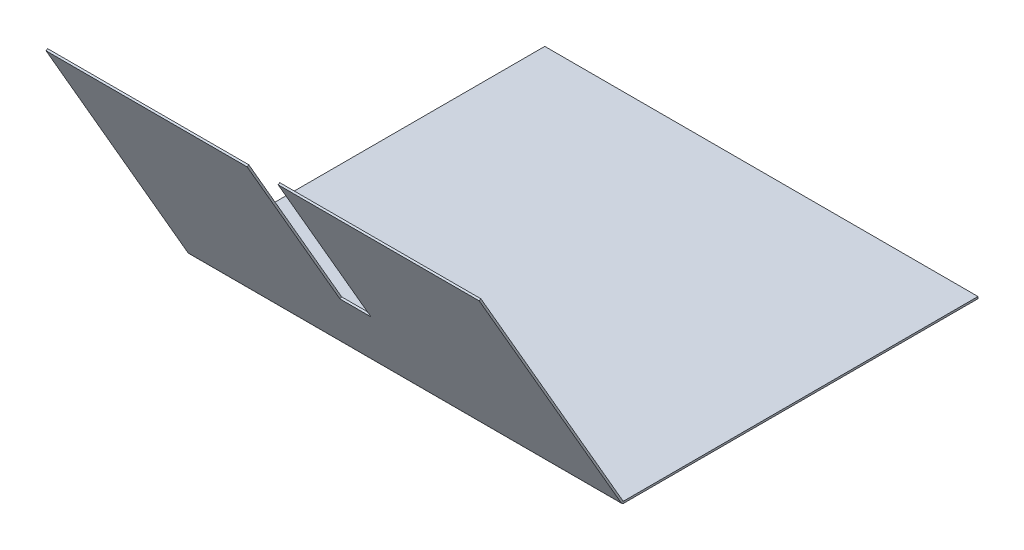
ISO-10303-21;
HEADER;
FILE_DESCRIPTION(('STEP AP214'),'2;1');
FILE_NAME('part.step','',(''),(''),'','','');
FILE_SCHEMA(('AUTOMOTIVE_DESIGN { 1 0 10303 214 1 1 1 1 }'));
ENDSEC;
DATA;
#1=APPLICATION_CONTEXT('core data for automotive mechanical design processes');
#2=APPLICATION_PROTOCOL_DEFINITION('international standard','automotive_design',2000,#1);
#3=PRODUCT_CONTEXT('',#1,'mechanical');
#4=PRODUCT('Part','Part','',(#3));
#5=PRODUCT_RELATED_PRODUCT_CATEGORY('part','',(#4));
#6=PRODUCT_DEFINITION_FORMATION('','',#4);
#7=PRODUCT_DEFINITION_CONTEXT('part definition',#1,'design');
#8=PRODUCT_DEFINITION('design','',#6,#7);
#9=PRODUCT_DEFINITION_SHAPE('','',#8);
#10=(LENGTH_UNIT() NAMED_UNIT(*) SI_UNIT(.MILLI.,.METRE.));
#11=(NAMED_UNIT(*) PLANE_ANGLE_UNIT() SI_UNIT($,.RADIAN.));
#12=(NAMED_UNIT(*) SI_UNIT($,.STERADIAN.) SOLID_ANGLE_UNIT());
#13=UNCERTAINTY_MEASURE_WITH_UNIT(LENGTH_MEASURE(1.E-05),#10,'distance_accuracy_value','');
#14=(GEOMETRIC_REPRESENTATION_CONTEXT(3) GLOBAL_UNCERTAINTY_ASSIGNED_CONTEXT((#13)) GLOBAL_UNIT_ASSIGNED_CONTEXT((#10,
#11,#12)) REPRESENTATION_CONTEXT('',''));
#15=CARTESIAN_POINT('',(0.,0.,0.));
#16=DIRECTION('',(0.,0.,1.));
#17=DIRECTION('',(1.,0.,0.));
#18=AXIS2_PLACEMENT_3D('',#15,#16,#17);
#19=CARTESIAN_POINT('',(-355.6,203.2,409.417574699331));
#20=DIRECTION('',(0.,-0.866025403784453,-0.499999999999976));
#21=DIRECTION('',(0.,0.499999999999976,-0.866025403784453));
#22=AXIS2_PLACEMENT_3D('',#19,#20,#21);
#23=PLANE('',#22);
#24=DIRECTION('',(1.,0.,0.));
#25=VECTOR('',#24,1.);
#26=CARTESIAN_POINT('',(-355.6,203.2,409.417574699331));
#27=LINE('',#26,#25);
#28=CARTESIAN_POINT('',(-355.6,203.2,409.417574699331));
#29=VERTEX_POINT('',#28);
#30=CARTESIAN_POINT('',(-190.5,203.2,409.417574699331));
#31=VERTEX_POINT('',#30);
#32=EDGE_CURVE('E186',#29,#31,#27,.T.);
#33=ORIENTED_EDGE('',*,*,#32,.T.);
#34=DIRECTION('',(0.,0.499999999999976,-0.866025403784453));
#35=VECTOR('',#34,1.);
#36=CARTESIAN_POINT('',(-190.5,203.2,409.417574699331));
#37=LINE('',#36,#35);
#38=CARTESIAN_POINT('',(-190.5,203.99375,408.042759370823));
#39=VERTEX_POINT('',#38);
#40=EDGE_CURVE('E11',#31,#39,#37,.T.);
#41=ORIENTED_EDGE('',*,*,#40,.T.);
#42=DIRECTION('',(1.,0.,0.));
#43=VECTOR('',#42,1.);
#44=CARTESIAN_POINT('',(-355.6,203.99375,408.042759370823));
#45=LINE('',#44,#43);
#46=CARTESIAN_POINT('',(-355.6,203.99375,408.042759370823));
#47=VERTEX_POINT('',#46);
#48=EDGE_CURVE('E190',#47,#39,#45,.T.);
#49=ORIENTED_EDGE('',*,*,#48,.F.);
#50=DIRECTION('',(0.,0.499999999999976,-0.866025403784453));
#51=VECTOR('',#50,1.);
#52=CARTESIAN_POINT('',(-355.6,203.2,409.417574699331));
#53=LINE('',#52,#51);
#54=EDGE_CURVE('E104',#29,#47,#53,.T.);
#55=ORIENTED_EDGE('',*,*,#54,.F.);
#56=EDGE_LOOP('',(#33,#41,#49,#55));
#57=FACE_BOUND('',#56,.T.);
#58=ADVANCED_FACE('F37',(#57),#23,.F.);
#59=CARTESIAN_POINT('',(-355.6,0.,290.758180239376));
#60=DIRECTION('',(-1.,0.,0.));
#61=DIRECTION('',(0.,0.,1.));
#62=AXIS2_PLACEMENT_3D('',#59,#60,#61);
#63=PLANE('',#62);
#64=DIRECTION('',(0.,1.,0.));
#65=VECTOR('',#64,1.);
#66=CARTESIAN_POINT('',(-355.6,0.,290.758180239376));
#67=LINE('',#66,#65);
#68=CARTESIAN_POINT('',(-355.6,0.,290.758180239376));
#69=VERTEX_POINT('',#68);
#70=CARTESIAN_POINT('',(-355.6,1.58749999999996,290.758180239376));
#71=VERTEX_POINT('',#70);
#72=EDGE_CURVE('E144',#69,#71,#67,.T.);
#73=ORIENTED_EDGE('',*,*,#72,.F.);
#74=CARTESIAN_POINT('',(-355.6,2.32409999999996,290.758180239376));
#75=DIRECTION('',(1.,0.,0.));
#76=DIRECTION('',(0.,0.,-1.));
#77=AXIS2_PLACEMENT_3D('',#74,#75,#76);
#78=CIRCLE('',#77,2.3241);
#79=CARTESIAN_POINT('',(-355.6,1.16204999999998,292.770909880312));
#80=VERTEX_POINT('',#79);
#81=EDGE_CURVE('E223',#69,#80,#78,.F.);
#82=ORIENTED_EDGE('',*,*,#81,.T.);
#83=DIRECTION('',(0.,-0.499999999999998,0.86602540378444));
#84=VECTOR('',#83,1.);
#85=CARTESIAN_POINT('',(-355.6,1.95579999999998,291.396094551804));
#86=LINE('',#85,#84);
#87=CARTESIAN_POINT('',(-355.6,1.95579999999998,291.396094551804));
#88=VERTEX_POINT('',#87);
#89=EDGE_CURVE('E61',#88,#80,#86,.T.);
#90=ORIENTED_EDGE('',*,*,#89,.F.);
#91=CARTESIAN_POINT('',(-355.6,2.32409999999996,290.758180239376));
#92=DIRECTION('',(1.,0.,0.));
#93=DIRECTION('',(0.,0.,-1.));
#94=AXIS2_PLACEMENT_3D('',#91,#92,#93);
#95=CIRCLE('',#94,0.7366);
#96=EDGE_CURVE('E146',#71,#88,#95,.F.);
#97=ORIENTED_EDGE('',*,*,#96,.F.);
#98=EDGE_LOOP('',(#73,#82,#90,#97));
#99=FACE_BOUND('',#98,.T.);
#100=ADVANCED_FACE('F39',(#99),#63,.T.);
#101=CARTESIAN_POINT('',(-355.6,1.95579999999998,291.396094551804));
#102=DIRECTION('',(-1.,0.,0.));
#103=DIRECTION('',(0.,0.,1.));
#104=AXIS2_PLACEMENT_3D('',#101,#102,#103);
#105=PLANE('',#104);
#106=DIRECTION('',(0.,0.,1.));
#107=VECTOR('',#106,1.);
#108=CARTESIAN_POINT('',(-355.6,0.,0.));
#109=LINE('',#108,#107);
#110=CARTESIAN_POINT('',(-355.6,0.,0.));
#111=VERTEX_POINT('',#110);
#112=EDGE_CURVE('E141',#111,#69,#109,.T.);
#113=ORIENTED_EDGE('',*,*,#112,.T.);
#114=ORIENTED_EDGE('',*,*,#72,.T.);
#115=DIRECTION('',(0.,0.,1.));
#116=VECTOR('',#115,1.);
#117=CARTESIAN_POINT('',(-355.6,1.5875,0.));
#118=LINE('',#117,#116);
#119=CARTESIAN_POINT('',(-355.6,1.5875,0.));
#120=VERTEX_POINT('',#119);
#121=EDGE_CURVE('E126',#120,#71,#118,.T.);
#122=ORIENTED_EDGE('',*,*,#121,.F.);
#123=DIRECTION('',(0.,-1.,0.));
#124=VECTOR('',#123,1.);
#125=CARTESIAN_POINT('',(-355.6,1.5875,0.));
#126=LINE('',#125,#124);
#127=EDGE_CURVE('E135',#120,#111,#126,.T.);
#128=ORIENTED_EDGE('',*,*,#127,.T.);
#129=EDGE_LOOP('',(#113,#114,#122,#128));
#130=FACE_BOUND('',#129,.T.);
#131=ADVANCED_FACE('F143',(#130),#105,.T.);
#132=CARTESIAN_POINT('',(0.,1.16204999999998,292.770909880312));
#133=DIRECTION('',(1.,0.,0.));
#134=DIRECTION('',(0.,0.,-1.));
#135=AXIS2_PLACEMENT_3D('',#132,#133,#134);
#136=PLANE('',#135);
#137=DIRECTION('',(0.,0.499999999999998,-0.86602540378444));
#138=VECTOR('',#137,1.);
#139=CARTESIAN_POINT('',(0.,1.16204999999998,292.770909880312));
#140=LINE('',#139,#138);
#141=CARTESIAN_POINT('',(0.,1.16204999999998,292.770909880312));
#142=VERTEX_POINT('',#141);
#143=CARTESIAN_POINT('',(0.,1.95579999999998,291.396094551804));
#144=VERTEX_POINT('',#143);
#145=EDGE_CURVE('E95',#142,#144,#140,.T.);
#146=ORIENTED_EDGE('',*,*,#145,.F.);
#147=CARTESIAN_POINT('',(0.,2.32409999999996,290.758180239376));
#148=DIRECTION('',(1.,0.,0.));
#149=DIRECTION('',(0.,0.,-1.));
#150=AXIS2_PLACEMENT_3D('',#147,#148,#149);
#151=CIRCLE('',#150,2.3241);
#152=CARTESIAN_POINT('',(0.,0.,290.758180239376));
#153=VERTEX_POINT('',#152);
#154=EDGE_CURVE('E162',#153,#142,#151,.F.);
#155=ORIENTED_EDGE('',*,*,#154,.F.);
#156=DIRECTION('',(0.,-1.,0.));
#157=VECTOR('',#156,1.);
#158=CARTESIAN_POINT('',(0.,1.58749999999996,290.758180239376));
#159=LINE('',#158,#157);
#160=CARTESIAN_POINT('',(0.,1.58749999999996,290.758180239376));
#161=VERTEX_POINT('',#160);
#162=EDGE_CURVE('E177',#161,#153,#159,.T.);
#163=ORIENTED_EDGE('',*,*,#162,.F.);
#164=CARTESIAN_POINT('',(0.,2.32409999999996,290.758180239376));
#165=DIRECTION('',(1.,0.,0.));
#166=DIRECTION('',(0.,0.,-1.));
#167=AXIS2_PLACEMENT_3D('',#164,#165,#166);
#168=CIRCLE('',#167,0.7366);
#169=EDGE_CURVE('E171',#161,#144,#168,.F.);
#170=ORIENTED_EDGE('',*,*,#169,.T.);
#171=EDGE_LOOP('',(#146,#155,#163,#170));
#172=FACE_BOUND('',#171,.T.);
#173=ADVANCED_FACE('F218',(#172),#136,.T.);
#174=CARTESIAN_POINT('',(0.,1.58749999999996,290.758180239376));
#175=DIRECTION('',(1.,0.,0.));
#176=DIRECTION('',(0.,0.,-1.));
#177=AXIS2_PLACEMENT_3D('',#174,#175,#176);
#178=PLANE('',#177);
#179=DIRECTION('',(0.,0.86602540378444,0.499999999999998));
#180=VECTOR('',#179,1.);
#181=CARTESIAN_POINT('',(0.,0.,292.1));
#182=LINE('',#181,#180);
#183=CARTESIAN_POINT('',(0.,203.2,409.417574699331));
#184=VERTEX_POINT('',#183);
#185=EDGE_CURVE('E159',#142,#184,#182,.T.);
#186=ORIENTED_EDGE('',*,*,#185,.F.);
#187=ORIENTED_EDGE('',*,*,#145,.T.);
#188=DIRECTION('',(0.,0.86602540378444,0.499999999999998));
#189=VECTOR('',#188,1.);
#190=CARTESIAN_POINT('',(0.,0.793749999999961,290.725184671492));
#191=LINE('',#190,#189);
#192=CARTESIAN_POINT('',(0.,203.99375,408.042759370823));
#193=VERTEX_POINT('',#192);
#194=EDGE_CURVE('E153',#144,#193,#191,.T.);
#195=ORIENTED_EDGE('',*,*,#194,.T.);
#196=DIRECTION('',(0.,0.499999999999976,-0.866025403784453));
#197=VECTOR('',#196,1.);
#198=CARTESIAN_POINT('',(0.,203.2,409.417574699331));
#199=LINE('',#198,#197);
#200=EDGE_CURVE('E155',#184,#193,#199,.T.);
#201=ORIENTED_EDGE('',*,*,#200,.F.);
#202=EDGE_LOOP('',(#186,#187,#195,#201));
#203=FACE_BOUND('',#202,.T.);
#204=ADVANCED_FACE('F210',(#203),#178,.T.);
#205=CARTESIAN_POINT('',(-355.6,0.793749999999961,290.725184671492));
#206=DIRECTION('',(0.,0.499999999999998,-0.86602540378444));
#207=DIRECTION('',(0.,0.86602540378444,0.499999999999998));
#208=AXIS2_PLACEMENT_3D('',#205,#206,#207);
#209=PLANE('',#208);
#210=DIRECTION('',(0.,0.86602540378444,0.499999999999998));
#211=VECTOR('',#210,1.);
#212=CARTESIAN_POINT('',(-190.5,0.793749999999987,290.725184671492));
#213=LINE('',#212,#211);
#214=CARTESIAN_POINT('',(-190.5,72.0114784632514,331.842759370824));
#215=VERTEX_POINT('',#214);
#216=EDGE_CURVE('E238',#215,#39,#213,.T.);
#217=ORIENTED_EDGE('',*,*,#216,.F.);
#218=DIRECTION('',(-1.,0.,0.));
#219=VECTOR('',#218,1.);
#220=CARTESIAN_POINT('',(-355.6,72.0114784632514,331.842759370824));
#221=LINE('',#220,#219);
#222=CARTESIAN_POINT('',(-165.1,72.0114784632514,331.842759370824));
#223=VERTEX_POINT('',#222);
#224=EDGE_CURVE('E156',#223,#215,#221,.T.);
#225=ORIENTED_EDGE('',*,*,#224,.F.);
#226=DIRECTION('',(0.,-0.86602540378444,-0.499999999999998));
#227=VECTOR('',#226,1.);
#228=CARTESIAN_POINT('',(-165.1,0.793749999999961,290.725184671492));
#229=LINE('',#228,#227);
#230=CARTESIAN_POINT('',(-165.1,203.99375,408.042759370823));
#231=VERTEX_POINT('',#230);
#232=EDGE_CURVE('E241',#231,#223,#229,.T.);
#233=ORIENTED_EDGE('',*,*,#232,.F.);
#234=EDGE_CURVE('E149',#231,#193,#45,.T.);
#235=ORIENTED_EDGE('',*,*,#234,.T.);
#236=ORIENTED_EDGE('',*,*,#194,.F.);
#237=DIRECTION('',(1.,0.,0.));
#238=VECTOR('',#237,1.);
#239=CARTESIAN_POINT('',(-355.6,1.95579999999998,291.396094551804));
#240=LINE('',#239,#238);
#241=EDGE_CURVE('E175',#88,#144,#240,.T.);
#242=ORIENTED_EDGE('',*,*,#241,.F.);
#243=DIRECTION('',(0.,0.86602540378444,0.499999999999998));
#244=VECTOR('',#243,1.);
#245=CARTESIAN_POINT('',(-355.6,0.793749999999961,290.725184671492));
#246=LINE('',#245,#244);
#247=EDGE_CURVE('E174',#88,#47,#246,.T.);
#248=ORIENTED_EDGE('',*,*,#247,.T.);
#249=ORIENTED_EDGE('',*,*,#48,.T.);
#250=EDGE_LOOP('',(#217,#225,#233,#235,#236,#242,#248,#249));
#251=FACE_BOUND('',#250,.T.);
#252=ADVANCED_FACE('F214',(#251),#209,.T.);
#253=CARTESIAN_POINT('',(-355.6,2.32409999999996,290.758180239376));
#254=DIRECTION('',(1.,0.,0.));
#255=DIRECTION('',(0.,0.,-1.));
#256=AXIS2_PLACEMENT_3D('',#253,#254,#255);
#257=CYLINDRICAL_SURFACE('',#256,0.7366);
#258=ORIENTED_EDGE('',*,*,#169,.F.);
#259=DIRECTION('',(1.,0.,0.));
#260=VECTOR('',#259,1.);
#261=CARTESIAN_POINT('',(-355.6,1.58749999999996,290.758180239376));
#262=LINE('',#261,#260);
#263=EDGE_CURVE('E131',#71,#161,#262,.T.);
#264=ORIENTED_EDGE('',*,*,#263,.F.);
#265=ORIENTED_EDGE('',*,*,#96,.T.);
#266=ORIENTED_EDGE('',*,*,#241,.T.);
#267=EDGE_LOOP('',(#258,#264,#265,#266));
#268=FACE_BOUND('',#267,.T.);
#269=ADVANCED_FACE('F221',(#268),#257,.F.);
#270=CARTESIAN_POINT('',(-355.6,1.5875,0.));
#271=DIRECTION('',(0.,1.,0.));
#272=DIRECTION('',(0.,0.,1.));
#273=AXIS2_PLACEMENT_3D('',#270,#271,#272);
#274=PLANE('',#273);
#275=DIRECTION('',(0.,0.,1.));
#276=VECTOR('',#275,1.);
#277=CARTESIAN_POINT('',(0.,1.5875,0.));
#278=LINE('',#277,#276);
#279=CARTESIAN_POINT('',(0.,1.5875,0.));
#280=VERTEX_POINT('',#279);
#281=EDGE_CURVE('E128',#280,#161,#278,.T.);
#282=ORIENTED_EDGE('',*,*,#281,.F.);
#283=DIRECTION('',(1.,0.,0.));
#284=VECTOR('',#283,1.);
#285=CARTESIAN_POINT('',(-355.6,1.5875,0.));
#286=LINE('',#285,#284);
#287=EDGE_CURVE('E121',#120,#280,#286,.T.);
#288=ORIENTED_EDGE('',*,*,#287,.F.);
#289=ORIENTED_EDGE('',*,*,#121,.T.);
#290=ORIENTED_EDGE('',*,*,#263,.T.);
#291=EDGE_LOOP('',(#282,#288,#289,#290));
#292=FACE_BOUND('',#291,.T.);
#293=ADVANCED_FACE('F123',(#292),#274,.T.);
#294=CARTESIAN_POINT('',(-355.6,1.5875,0.));
#295=DIRECTION('',(0.,0.,1.));
#296=DIRECTION('',(0.,-1.,0.));
#297=AXIS2_PLACEMENT_3D('',#294,#295,#296);
#298=PLANE('',#297);
#299=DIRECTION('',(0.,-1.,0.));
#300=VECTOR('',#299,1.);
#301=CARTESIAN_POINT('',(0.,1.5875,0.));
#302=LINE('',#301,#300);
#303=CARTESIAN_POINT('',(0.,0.,0.));
#304=VERTEX_POINT('',#303);
#305=EDGE_CURVE('E168',#280,#304,#302,.T.);
#306=ORIENTED_EDGE('',*,*,#305,.T.);
#307=DIRECTION('',(1.,0.,0.));
#308=VECTOR('',#307,1.);
#309=CARTESIAN_POINT('',(-355.6,0.,0.));
#310=LINE('',#309,#308);
#311=EDGE_CURVE('E132',#111,#304,#310,.T.);
#312=ORIENTED_EDGE('',*,*,#311,.F.);
#313=ORIENTED_EDGE('',*,*,#127,.F.);
#314=ORIENTED_EDGE('',*,*,#287,.T.);
#315=EDGE_LOOP('',(#306,#312,#313,#314));
#316=FACE_BOUND('',#315,.T.);
#317=ADVANCED_FACE('F136',(#316),#298,.F.);
#318=CARTESIAN_POINT('',(-355.6,0.,0.));
#319=DIRECTION('',(0.,1.,0.));
#320=DIRECTION('',(0.,0.,1.));
#321=AXIS2_PLACEMENT_3D('',#318,#319,#320);
#322=PLANE('',#321);
#323=DIRECTION('',(0.,0.,1.));
#324=VECTOR('',#323,1.);
#325=CARTESIAN_POINT('',(0.,0.,0.));
#326=LINE('',#325,#324);
#327=EDGE_CURVE('E165',#304,#153,#326,.T.);
#328=ORIENTED_EDGE('',*,*,#327,.T.);
#329=DIRECTION('',(1.,0.,0.));
#330=VECTOR('',#329,1.);
#331=CARTESIAN_POINT('',(-355.6,0.,290.758180239376));
#332=LINE('',#331,#330);
#333=EDGE_CURVE('E180',#69,#153,#332,.T.);
#334=ORIENTED_EDGE('',*,*,#333,.F.);
#335=ORIENTED_EDGE('',*,*,#112,.F.);
#336=ORIENTED_EDGE('',*,*,#311,.T.);
#337=EDGE_LOOP('',(#328,#334,#335,#336));
#338=FACE_BOUND('',#337,.T.);
#339=ADVANCED_FACE('F226',(#338),#322,.F.);
#340=CARTESIAN_POINT('',(-355.6,2.32409999999996,290.758180239376));
#341=DIRECTION('',(1.,0.,0.));
#342=DIRECTION('',(0.,0.,-1.));
#343=AXIS2_PLACEMENT_3D('',#340,#341,#342);
#344=CYLINDRICAL_SURFACE('',#343,2.3241);
#345=ORIENTED_EDGE('',*,*,#154,.T.);
#346=DIRECTION('',(1.,0.,0.));
#347=VECTOR('',#346,1.);
#348=CARTESIAN_POINT('',(-355.6,1.16204999999998,292.770909880312));
#349=LINE('',#348,#347);
#350=EDGE_CURVE('E183',#80,#142,#349,.T.);
#351=ORIENTED_EDGE('',*,*,#350,.F.);
#352=ORIENTED_EDGE('',*,*,#81,.F.);
#353=ORIENTED_EDGE('',*,*,#333,.T.);
#354=EDGE_LOOP('',(#345,#351,#352,#353));
#355=FACE_BOUND('',#354,.T.);
#356=ADVANCED_FACE('F229',(#355),#344,.T.);
#357=CARTESIAN_POINT('',(-355.6,0.,292.1));
#358=DIRECTION('',(0.,0.499999999999998,-0.86602540378444));
#359=DIRECTION('',(0.,0.86602540378444,0.499999999999998));
#360=AXIS2_PLACEMENT_3D('',#357,#358,#359);
#361=PLANE('',#360);
#362=DIRECTION('',(1.,0.,0.));
#363=VECTOR('',#362,1.);
#364=CARTESIAN_POINT('',(-190.5,71.2177284632514,333.217574699332));
#365=LINE('',#364,#363);
#366=CARTESIAN_POINT('',(-190.5,71.2177284632514,333.217574699332));
#367=VERTEX_POINT('',#366);
#368=CARTESIAN_POINT('',(-165.1,71.2177284632514,333.217574699332));
#369=VERTEX_POINT('',#368);
#370=EDGE_CURVE('E249',#367,#369,#365,.T.);
#371=ORIENTED_EDGE('',*,*,#370,.F.);
#372=DIRECTION('',(0.,-0.86602540378444,-0.499999999999998));
#373=VECTOR('',#372,1.);
#374=CARTESIAN_POINT('',(-190.5,203.2,409.417574699331));
#375=LINE('',#374,#373);
#376=EDGE_CURVE('E252',#31,#367,#375,.T.);
#377=ORIENTED_EDGE('',*,*,#376,.F.);
#378=ORIENTED_EDGE('',*,*,#32,.F.);
#379=DIRECTION('',(0.,0.86602540378444,0.499999999999998));
#380=VECTOR('',#379,1.);
#381=CARTESIAN_POINT('',(-355.6,0.,292.1));
#382=LINE('',#381,#380);
#383=EDGE_CURVE('E230',#80,#29,#382,.T.);
#384=ORIENTED_EDGE('',*,*,#383,.F.);
#385=ORIENTED_EDGE('',*,*,#350,.T.);
#386=ORIENTED_EDGE('',*,*,#185,.T.);
#387=CARTESIAN_POINT('',(-165.1,203.2,409.417574699331));
#388=VERTEX_POINT('',#387);
#389=EDGE_CURVE('E189',#388,#184,#27,.T.);
#390=ORIENTED_EDGE('',*,*,#389,.F.);
#391=DIRECTION('',(0.,0.86602540378444,0.499999999999998));
#392=VECTOR('',#391,1.);
#393=CARTESIAN_POINT('',(-165.1,203.2,409.417574699331));
#394=LINE('',#393,#392);
#395=EDGE_CURVE('E52',#369,#388,#394,.T.);
#396=ORIENTED_EDGE('',*,*,#395,.F.);
#397=EDGE_LOOP('',(#371,#377,#378,#384,#385,#386,#390,#396));
#398=FACE_BOUND('',#397,.T.);
#399=ADVANCED_FACE('F205',(#398),#361,.F.);
#400=ORIENTED_EDGE('',*,*,#234,.F.);
#401=DIRECTION('',(0.,-0.499999999999976,0.866025403784453));
#402=VECTOR('',#401,1.);
#403=CARTESIAN_POINT('',(-165.1,203.2,409.417574699331));
#404=LINE('',#403,#402);
#405=EDGE_CURVE('E45',#231,#388,#404,.T.);
#406=ORIENTED_EDGE('',*,*,#405,.T.);
#407=ORIENTED_EDGE('',*,*,#389,.T.);
#408=ORIENTED_EDGE('',*,*,#200,.T.);
#409=EDGE_LOOP('',(#400,#406,#407,#408));
#410=FACE_BOUND('',#409,.T.);
#411=ADVANCED_FACE('F199',(#410),#23,.F.);
#412=CARTESIAN_POINT('',(-355.6,2.32409999999996,290.758180239376));
#413=DIRECTION('',(1.,0.,0.));
#414=DIRECTION('',(0.,0.,-1.));
#415=AXIS2_PLACEMENT_3D('',#412,#413,#414);
#416=PLANE('',#415);
#417=ORIENTED_EDGE('',*,*,#247,.F.);
#418=ORIENTED_EDGE('',*,*,#89,.T.);
#419=ORIENTED_EDGE('',*,*,#383,.T.);
#420=ORIENTED_EDGE('',*,*,#54,.T.);
#421=EDGE_LOOP('',(#417,#418,#419,#420));
#422=FACE_BOUND('',#421,.T.);
#423=ADVANCED_FACE('F274',(#422),#416,.F.);
#424=CARTESIAN_POINT('',(0.,2.32409999999996,290.758180239376));
#425=DIRECTION('',(1.,0.,0.));
#426=DIRECTION('',(0.,0.,-1.));
#427=AXIS2_PLACEMENT_3D('',#424,#425,#426);
#428=PLANE('',#427);
#429=ORIENTED_EDGE('',*,*,#281,.T.);
#430=ORIENTED_EDGE('',*,*,#162,.T.);
#431=ORIENTED_EDGE('',*,*,#327,.F.);
#432=ORIENTED_EDGE('',*,*,#305,.F.);
#433=EDGE_LOOP('',(#429,#430,#431,#432));
#434=FACE_BOUND('',#433,.T.);
#435=ADVANCED_FACE('F276',(#434),#428,.T.);
#436=CARTESIAN_POINT('',(-190.5,380.681447722716,102.010689842705));
#437=DIRECTION('',(-1.,0.,0.));
#438=DIRECTION('',(0.,-1.,0.));
#439=AXIS2_PLACEMENT_3D('',#436,#437,#438);
#440=PLANE('',#439);
#441=ORIENTED_EDGE('',*,*,#216,.T.);
#442=ORIENTED_EDGE('',*,*,#40,.F.);
#443=ORIENTED_EDGE('',*,*,#376,.T.);
#444=DIRECTION('',(0.,-0.499999999999998,0.86602540378444));
#445=VECTOR('',#444,1.);
#446=CARTESIAN_POINT('',(-190.5,248.699176185968,25.8106898427053));
#447=LINE('',#446,#445);
#448=EDGE_CURVE('E244',#215,#367,#447,.T.);
#449=ORIENTED_EDGE('',*,*,#448,.F.);
#450=EDGE_LOOP('',(#441,#442,#443,#449));
#451=FACE_BOUND('',#450,.T.);
#452=ADVANCED_FACE('F259',(#451),#440,.F.);
#453=CARTESIAN_POINT('',(-165.1,380.681447722716,102.010689842705));
#454=DIRECTION('',(1.,0.,0.));
#455=DIRECTION('',(0.,0.,-1.));
#456=AXIS2_PLACEMENT_3D('',#453,#454,#455);
#457=PLANE('',#456);
#458=ORIENTED_EDGE('',*,*,#232,.T.);
#459=DIRECTION('',(0.,-0.499999999999998,0.86602540378444));
#460=VECTOR('',#459,1.);
#461=CARTESIAN_POINT('',(-165.1,248.699176185968,25.8106898427053));
#462=LINE('',#461,#460);
#463=EDGE_CURVE('E243',#223,#369,#462,.T.);
#464=ORIENTED_EDGE('',*,*,#463,.T.);
#465=ORIENTED_EDGE('',*,*,#395,.T.);
#466=ORIENTED_EDGE('',*,*,#405,.F.);
#467=EDGE_LOOP('',(#458,#464,#465,#466));
#468=FACE_BOUND('',#467,.T.);
#469=ADVANCED_FACE('F364',(#468),#457,.F.);
#470=CARTESIAN_POINT('',(-190.5,248.699176185968,25.8106898427053));
#471=DIRECTION('',(0.,-0.86602540378444,-0.499999999999998));
#472=DIRECTION('',(0.,0.499999999999998,-0.86602540378444));
#473=AXIS2_PLACEMENT_3D('',#470,#471,#472);
#474=PLANE('',#473);
#475=ORIENTED_EDGE('',*,*,#224,.T.);
#476=ORIENTED_EDGE('',*,*,#448,.T.);
#477=ORIENTED_EDGE('',*,*,#370,.T.);
#478=ORIENTED_EDGE('',*,*,#463,.F.);
#479=EDGE_LOOP('',(#475,#476,#477,#478));
#480=FACE_BOUND('',#479,.T.);
#481=ADVANCED_FACE('F265',(#480),#474,.F.);
#482=CLOSED_SHELL('',(#58,#100,#131,#173,#204,#252,#269,#293,#317,#339,#356,#399,#411,#423,#435,
#452,#469,#481));
#483=MANIFOLD_SOLID_BREP('B2',#482);
#484=ADVANCED_BREP_SHAPE_REPRESENTATION('',(#18,#483),#14);
#485=SHAPE_DEFINITION_REPRESENTATION(#9,#484);
ENDSEC;
END-ISO-10303-21;
